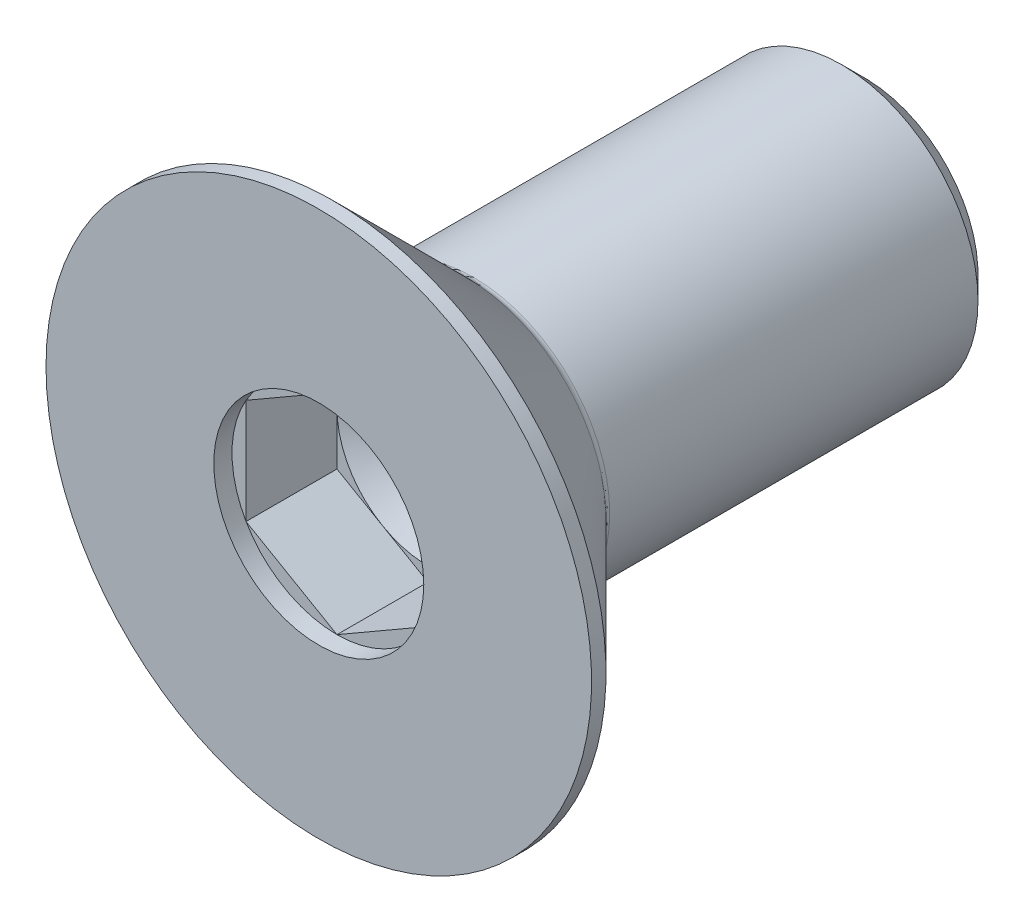
ISO-10303-21;
HEADER;
FILE_DESCRIPTION(('STEP AP214'),'2;1');
FILE_NAME('part.step','',(''),(''),'','','');
FILE_SCHEMA(('AUTOMOTIVE_DESIGN { 1 0 10303 214 1 1 1 1 }'));
ENDSEC;
DATA;
#1=APPLICATION_CONTEXT('core data for automotive mechanical design processes');
#2=APPLICATION_PROTOCOL_DEFINITION('international standard','automotive_design',2000,#1);
#3=PRODUCT_CONTEXT('',#1,'mechanical');
#4=PRODUCT('Part','Part','',(#3));
#5=PRODUCT_RELATED_PRODUCT_CATEGORY('part','',(#4));
#6=PRODUCT_DEFINITION_FORMATION('','',#4);
#7=PRODUCT_DEFINITION_CONTEXT('part definition',#1,'design');
#8=PRODUCT_DEFINITION('design','',#6,#7);
#9=PRODUCT_DEFINITION_SHAPE('','',#8);
#10=(LENGTH_UNIT() NAMED_UNIT(*) SI_UNIT(.MILLI.,.METRE.));
#11=(NAMED_UNIT(*) PLANE_ANGLE_UNIT() SI_UNIT($,.RADIAN.));
#12=(NAMED_UNIT(*) SI_UNIT($,.STERADIAN.) SOLID_ANGLE_UNIT());
#13=UNCERTAINTY_MEASURE_WITH_UNIT(LENGTH_MEASURE(1.E-05),#10,'distance_accuracy_value','');
#14=(GEOMETRIC_REPRESENTATION_CONTEXT(3) GLOBAL_UNCERTAINTY_ASSIGNED_CONTEXT((#13)) GLOBAL_UNIT_ASSIGNED_CONTEXT((#10,
#11,#12)) REPRESENTATION_CONTEXT('',''));
#15=CARTESIAN_POINT('',(0.,0.,0.));
#16=DIRECTION('',(0.,0.,1.));
#17=DIRECTION('',(1.,0.,0.));
#18=AXIS2_PLACEMENT_3D('',#15,#16,#17);
#19=CARTESIAN_POINT('',(0.,1.25,-6.00000000000001));
#20=DIRECTION('',(0.,0.,-1.));
#21=DIRECTION('',(-1.,0.,0.));
#22=AXIS2_PLACEMENT_3D('',#19,#20,#21);
#23=PLANE('',#22);
#24=CARTESIAN_POINT('',(0.,0.,-6.00000000000001));
#25=DIRECTION('',(0.,0.,-1.));
#26=DIRECTION('',(-1.,0.,0.));
#27=AXIS2_PLACEMENT_3D('',#24,#25,#26);
#28=CIRCLE('',#27,1.25);
#29=CARTESIAN_POINT('',(-1.25,0.,-6.00000000000001));
#30=VERTEX_POINT('',#29);
#31=EDGE_CURVE('E179',#30,#30,#28,.T.);
#32=ORIENTED_EDGE('',*,*,#31,.T.);
#33=EDGE_LOOP('',(#32));
#34=FACE_BOUND('',#33,.T.);
#35=ADVANCED_FACE('F35',(#34),#23,.T.);
#36=CARTESIAN_POINT('',(0.,0.,-6.00000000000001));
#37=DIRECTION('',(0.,0.,1.));
#38=DIRECTION('',(1.,0.,0.));
#39=AXIS2_PLACEMENT_3D('',#36,#37,#38);
#40=CONICAL_SURFACE('',#39,1.25,0.785398163397449);
#41=CARTESIAN_POINT('',(0.,0.,-5.75000000000001));
#42=DIRECTION('',(0.,0.,-1.));
#43=DIRECTION('',(-1.,0.,0.));
#44=AXIS2_PLACEMENT_3D('',#41,#42,#43);
#45=CIRCLE('',#44,1.5);
#46=CARTESIAN_POINT('',(-1.5,0.,-5.75000000000001));
#47=VERTEX_POINT('',#46);
#48=EDGE_CURVE('E177',#47,#47,#45,.T.);
#49=ORIENTED_EDGE('',*,*,#48,.T.);
#50=EDGE_LOOP('',(#49));
#51=FACE_BOUND('',#50,.T.);
#52=ORIENTED_EDGE('',*,*,#31,.F.);
#53=EDGE_LOOP('',(#52));
#54=FACE_BOUND('',#53,.T.);
#55=ADVANCED_FACE('F266',(#51,#54),#40,.T.);
#56=CARTESIAN_POINT('',(0.,0.,0.));
#57=DIRECTION('',(0.,0.,-1.));
#58=DIRECTION('',(-1.,0.,0.));
#59=AXIS2_PLACEMENT_3D('',#56,#57,#58);
#60=CYLINDRICAL_SURFACE('',#59,1.5);
#61=CARTESIAN_POINT('',(0.,0.,-1.7));
#62=DIRECTION('',(0.,0.,-1.));
#63=DIRECTION('',(-1.,0.,0.));
#64=AXIS2_PLACEMENT_3D('',#61,#62,#63);
#65=CIRCLE('',#64,1.5);
#66=CARTESIAN_POINT('',(-1.5,0.,-1.7));
#67=VERTEX_POINT('',#66);
#68=EDGE_CURVE('E174',#67,#67,#65,.T.);
#69=ORIENTED_EDGE('',*,*,#68,.T.);
#70=EDGE_LOOP('',(#69));
#71=FACE_BOUND('',#70,.T.);
#72=ORIENTED_EDGE('',*,*,#48,.F.);
#73=EDGE_LOOP('',(#72));
#74=FACE_BOUND('',#73,.T.);
#75=ADVANCED_FACE('F260',(#71,#74),#60,.T.);
#76=CARTESIAN_POINT('',(0.,0.,-1.7));
#77=DIRECTION('',(0.,0.,-1.));
#78=DIRECTION('',(-1.,0.,0.));
#79=AXIS2_PLACEMENT_3D('',#76,#77,#78);
#80=TOROIDAL_SURFACE('',#79,1.6,0.0999999999999993);
#81=CARTESIAN_POINT('',(0.,0.,-1.62928932188135));
#82=DIRECTION('',(0.,0.,-1.));
#83=DIRECTION('',(-1.,0.,0.));
#84=AXIS2_PLACEMENT_3D('',#81,#82,#83);
#85=CIRCLE('',#84,1.52928932188135);
#86=CARTESIAN_POINT('',(-1.52928932188135,0.,-1.62928932188135));
#87=VERTEX_POINT('',#86);
#88=EDGE_CURVE('E171',#87,#87,#85,.T.);
#89=ORIENTED_EDGE('',*,*,#88,.T.);
#90=EDGE_LOOP('',(#89));
#91=FACE_BOUND('',#90,.T.);
#92=ORIENTED_EDGE('',*,*,#68,.F.);
#93=EDGE_LOOP('',(#92));
#94=FACE_BOUND('',#93,.T.);
#95=ADVANCED_FACE('F254',(#91,#94),#80,.F.);
#96=CARTESIAN_POINT('',(0.,0.,-1.62928932188135));
#97=DIRECTION('',(0.,0.,1.));
#98=DIRECTION('',(1.,0.,0.));
#99=AXIS2_PLACEMENT_3D('',#96,#97,#98);
#100=CONICAL_SURFACE('',#99,1.52928932188135,0.785398163397442);
#101=CARTESIAN_POINT('',(0.,0.,-0.158578643762677));
#102=DIRECTION('',(0.,0.,-1.));
#103=DIRECTION('',(-1.,0.,0.));
#104=AXIS2_PLACEMENT_3D('',#101,#102,#103);
#105=CIRCLE('',#104,3.);
#106=CARTESIAN_POINT('',(-3.,0.,-0.158578643762677));
#107=VERTEX_POINT('',#106);
#108=EDGE_CURVE('E151',#107,#107,#105,.T.);
#109=ORIENTED_EDGE('',*,*,#108,.T.);
#110=EDGE_LOOP('',(#109));
#111=FACE_BOUND('',#110,.T.);
#112=ORIENTED_EDGE('',*,*,#88,.F.);
#113=EDGE_LOOP('',(#112));
#114=FACE_BOUND('',#113,.T.);
#115=ADVANCED_FACE('F248',(#111,#114),#100,.T.);
#116=CARTESIAN_POINT('',(0.,0.,0.));
#117=DIRECTION('',(0.,0.,-1.));
#118=DIRECTION('',(-1.,0.,0.));
#119=AXIS2_PLACEMENT_3D('',#116,#117,#118);
#120=CYLINDRICAL_SURFACE('',#119,3.);
#121=CARTESIAN_POINT('',(0.,0.,0.));
#122=DIRECTION('',(0.,0.,-1.));
#123=DIRECTION('',(-1.,0.,0.));
#124=AXIS2_PLACEMENT_3D('',#121,#122,#123);
#125=CIRCLE('',#124,3.);
#126=CARTESIAN_POINT('',(-3.,0.,0.));
#127=VERTEX_POINT('',#126);
#128=EDGE_CURVE('E148',#127,#127,#125,.T.);
#129=ORIENTED_EDGE('',*,*,#128,.T.);
#130=EDGE_LOOP('',(#129));
#131=FACE_BOUND('',#130,.T.);
#132=ORIENTED_EDGE('',*,*,#108,.F.);
#133=EDGE_LOOP('',(#132));
#134=FACE_BOUND('',#133,.T.);
#135=ADVANCED_FACE('F242',(#131,#134),#120,.T.);
#136=CARTESIAN_POINT('',(0.,0.,0.));
#137=DIRECTION('',(0.,0.,1.));
#138=DIRECTION('',(1.,0.,0.));
#139=AXIS2_PLACEMENT_3D('',#136,#137,#138);
#140=PLANE('',#139);
#141=CARTESIAN_POINT('',(0.,0.,0.));
#142=DIRECTION('',(0.,0.,1.));
#143=DIRECTION('',(1.,0.,0.));
#144=AXIS2_PLACEMENT_3D('',#141,#142,#143);
#145=CIRCLE('',#144,1.15470053837925);
#146=CARTESIAN_POINT('',(1.15470053837925,0.,0.));
#147=VERTEX_POINT('',#146);
#148=EDGE_CURVE('E128',#147,#147,#145,.T.);
#149=ORIENTED_EDGE('',*,*,#148,.F.);
#150=EDGE_LOOP('',(#149));
#151=FACE_BOUND('',#150,.T.);
#152=ORIENTED_EDGE('',*,*,#128,.F.);
#153=EDGE_LOOP('',(#152));
#154=FACE_BOUND('',#153,.T.);
#155=ADVANCED_FACE('F239',(#151,#154),#140,.T.);
#156=CARTESIAN_POINT('',(0.,0.,-0.2));
#157=DIRECTION('',(0.,0.,1.));
#158=DIRECTION('',(1.,0.,0.));
#159=AXIS2_PLACEMENT_3D('',#156,#157,#158);
#160=CYLINDRICAL_SURFACE('',#159,1.15470053837925);
#161=ORIENTED_EDGE('',*,*,#148,.T.);
#162=EDGE_LOOP('',(#161));
#163=FACE_BOUND('',#162,.T.);
#164=CARTESIAN_POINT('',(0.,0.,-0.2));
#165=DIRECTION('',(0.,0.,1.));
#166=DIRECTION('',(1.,0.,0.));
#167=AXIS2_PLACEMENT_3D('',#164,#165,#166);
#168=CIRCLE('',#167,1.15470053837925);
#169=CARTESIAN_POINT('',(0.999999999999996,-0.57735026918963,-0.2));
#170=VERTEX_POINT('',#169);
#171=CARTESIAN_POINT('',(0.999999999999998,0.577350269189626,-0.2));
#172=VERTEX_POINT('',#171);
#173=EDGE_CURVE('E121',#170,#172,#168,.T.);
#174=ORIENTED_EDGE('',*,*,#173,.F.);
#175=CARTESIAN_POINT('',(0.,-1.15470053837925,-0.2));
#176=VERTEX_POINT('',#175);
#177=EDGE_CURVE('E127',#176,#170,#168,.T.);
#178=ORIENTED_EDGE('',*,*,#177,.F.);
#179=CARTESIAN_POINT('',(-1.,-0.577350269189621,-0.2));
#180=VERTEX_POINT('',#179);
#181=EDGE_CURVE('E494',#180,#176,#168,.T.);
#182=ORIENTED_EDGE('',*,*,#181,.F.);
#183=CARTESIAN_POINT('',(-1.,0.577350269189625,-0.2));
#184=VERTEX_POINT('',#183);
#185=EDGE_CURVE('E496',#184,#180,#168,.T.);
#186=ORIENTED_EDGE('',*,*,#185,.F.);
#187=CARTESIAN_POINT('',(0.,1.15470053837925,-0.2));
#188=VERTEX_POINT('',#187);
#189=EDGE_CURVE('E47',#188,#184,#168,.T.);
#190=ORIENTED_EDGE('',*,*,#189,.F.);
#191=EDGE_CURVE('E111',#172,#188,#168,.T.);
#192=ORIENTED_EDGE('',*,*,#191,.F.);
#193=EDGE_LOOP('',(#174,#178,#182,#186,#190,#192));
#194=FACE_BOUND('',#193,.T.);
#195=ADVANCED_FACE('F130',(#163,#194),#160,.F.);
#196=CARTESIAN_POINT('',(0.,0.,-0.2));
#197=DIRECTION('',(0.,0.,1.));
#198=DIRECTION('',(1.,0.,0.));
#199=AXIS2_PLACEMENT_3D('',#196,#197,#198);
#200=PLANE('',#199);
#201=DIRECTION('',(0.866025403784439,-0.5,0.));
#202=VECTOR('',#201,1.);
#203=CARTESIAN_POINT('',(0.999999999999998,0.577350269189625,-0.2));
#204=LINE('',#203,#202);
#205=EDGE_CURVE('E107',#188,#172,#204,.T.);
#206=ORIENTED_EDGE('',*,*,#205,.T.);
#207=ORIENTED_EDGE('',*,*,#191,.T.);
#208=EDGE_LOOP('',(#206,#207));
#209=FACE_BOUND('',#208,.T.);
#210=ADVANCED_FACE('F109',(#209),#200,.T.);
#211=DIRECTION('',(0.,-1.,0.));
#212=VECTOR('',#211,1.);
#213=CARTESIAN_POINT('',(0.999999999999998,-0.577350269189628,-0.2));
#214=LINE('',#213,#212);
#215=EDGE_CURVE('E117',#172,#170,#214,.T.);
#216=ORIENTED_EDGE('',*,*,#215,.T.);
#217=ORIENTED_EDGE('',*,*,#173,.T.);
#218=EDGE_LOOP('',(#216,#217));
#219=FACE_BOUND('',#218,.T.);
#220=ADVANCED_FACE('F122',(#219),#200,.T.);
#221=DIRECTION('',(-0.866025403784439,-0.5,0.));
#222=VECTOR('',#221,1.);
#223=CARTESIAN_POINT('',(0.,-1.15470053837925,-0.2));
#224=LINE('',#223,#222);
#225=EDGE_CURVE('E142',#170,#176,#224,.T.);
#226=ORIENTED_EDGE('',*,*,#225,.T.);
#227=ORIENTED_EDGE('',*,*,#177,.T.);
#228=EDGE_LOOP('',(#226,#227));
#229=FACE_BOUND('',#228,.T.);
#230=ADVANCED_FACE('F305',(#229),#200,.T.);
#231=DIRECTION('',(-0.866025403784439,0.5,0.));
#232=VECTOR('',#231,1.);
#233=CARTESIAN_POINT('',(-1.,-0.577350269189627,-0.2));
#234=LINE('',#233,#232);
#235=EDGE_CURVE('E229',#176,#180,#234,.T.);
#236=ORIENTED_EDGE('',*,*,#235,.T.);
#237=ORIENTED_EDGE('',*,*,#181,.T.);
#238=EDGE_LOOP('',(#236,#237));
#239=FACE_BOUND('',#238,.T.);
#240=ADVANCED_FACE('F311',(#239),#200,.T.);
#241=DIRECTION('',(0.,1.,0.));
#242=VECTOR('',#241,1.);
#243=CARTESIAN_POINT('',(-1.,0.577350269189625,-0.2));
#244=LINE('',#243,#242);
#245=EDGE_CURVE('E131',#180,#184,#244,.T.);
#246=ORIENTED_EDGE('',*,*,#245,.T.);
#247=ORIENTED_EDGE('',*,*,#185,.T.);
#248=EDGE_LOOP('',(#246,#247));
#249=FACE_BOUND('',#248,.T.);
#250=ADVANCED_FACE('F307',(#249),#200,.T.);
#251=DIRECTION('',(0.866025403784439,0.5,0.));
#252=VECTOR('',#251,1.);
#253=CARTESIAN_POINT('',(0.,1.15470053837925,-0.2));
#254=LINE('',#253,#252);
#255=EDGE_CURVE('E11',#184,#188,#254,.T.);
#256=ORIENTED_EDGE('',*,*,#255,.T.);
#257=ORIENTED_EDGE('',*,*,#189,.T.);
#258=EDGE_LOOP('',(#256,#257));
#259=FACE_BOUND('',#258,.T.);
#260=ADVANCED_FACE('F298',(#259),#200,.T.);
#261=CARTESIAN_POINT('',(0.,0.,-1.77735026918962));
#262=DIRECTION('',(0.,0.,1.));
#263=DIRECTION('',(1.,0.,0.));
#264=AXIS2_PLACEMENT_3D('',#261,#262,#263);
#265=CONICAL_SURFACE('',#264,0.,1.0471975511966);
#266=CARTESIAN_POINT('',(0.,0.,-1.2));
#267=DIRECTION('',(0.,0.,1.));
#268=DIRECTION('',(1.,0.,0.));
#269=AXIS2_PLACEMENT_3D('',#266,#267,#268);
#270=CIRCLE('',#269,1.);
#271=CARTESIAN_POINT('',(1.,0.,-1.2));
#272=VERTEX_POINT('',#271);
#273=CARTESIAN_POINT('',(0.5,0.866025403784439,-1.2));
#274=VERTEX_POINT('',#273);
#275=EDGE_CURVE('E116',#272,#274,#270,.T.);
#276=ORIENTED_EDGE('',*,*,#275,.T.);
#277=CARTESIAN_POINT('',(-0.5,0.866025403784439,-1.2));
#278=VERTEX_POINT('',#277);
#279=EDGE_CURVE('E42',#274,#278,#270,.T.);
#280=ORIENTED_EDGE('',*,*,#279,.T.);
#281=CARTESIAN_POINT('',(-1.,0.,-1.2));
#282=VERTEX_POINT('',#281);
#283=EDGE_CURVE('E190',#278,#282,#270,.T.);
#284=ORIENTED_EDGE('',*,*,#283,.T.);
#285=CARTESIAN_POINT('',(-0.5,-0.866025403784439,-1.2));
#286=VERTEX_POINT('',#285);
#287=EDGE_CURVE('E186',#282,#286,#270,.T.);
#288=ORIENTED_EDGE('',*,*,#287,.T.);
#289=CARTESIAN_POINT('',(0.5,-0.86602540378444,-1.2));
#290=VERTEX_POINT('',#289);
#291=EDGE_CURVE('E55',#286,#290,#270,.T.);
#292=ORIENTED_EDGE('',*,*,#291,.T.);
#293=EDGE_CURVE('E181',#290,#272,#270,.T.);
#294=ORIENTED_EDGE('',*,*,#293,.T.);
#295=EDGE_LOOP('',(#276,#280,#284,#288,#292,#294));
#296=FACE_BOUND('',#295,.T.);
#297=CARTESIAN_POINT('',(0.,0.,-1.77735026918962));
#298=VERTEX_POINT('',#297);
#299=VERTEX_LOOP('',#298);
#300=FACE_BOUND('',#299,.T.);
#301=ADVANCED_FACE('F193',(#296,#300),#265,.F.);
#302=CARTESIAN_POINT('',(0.,0.,-1.2));
#303=DIRECTION('',(0.,0.,1.));
#304=DIRECTION('',(1.,0.,0.));
#305=AXIS2_PLACEMENT_3D('',#302,#303,#304);
#306=PLANE('',#305);
#307=ORIENTED_EDGE('',*,*,#275,.F.);
#308=DIRECTION('',(0.,1.,0.));
#309=VECTOR('',#308,1.);
#310=CARTESIAN_POINT('',(0.999999999999998,-0.577350269189628,-1.2));
#311=LINE('',#310,#309);
#312=CARTESIAN_POINT('',(0.999999999999998,0.577350269189625,-1.2));
#313=VERTEX_POINT('',#312);
#314=EDGE_CURVE('E219',#272,#313,#311,.T.);
#315=ORIENTED_EDGE('',*,*,#314,.T.);
#316=DIRECTION('',(-0.866025403784439,0.5,0.));
#317=VECTOR('',#316,1.);
#318=CARTESIAN_POINT('',(0.999999999999998,0.577350269189625,-1.2));
#319=LINE('',#318,#317);
#320=EDGE_CURVE('E147',#313,#274,#319,.T.);
#321=ORIENTED_EDGE('',*,*,#320,.T.);
#322=EDGE_LOOP('',(#307,#315,#321));
#323=FACE_BOUND('',#322,.T.);
#324=ADVANCED_FACE('F295',(#323),#306,.T.);
#325=ORIENTED_EDGE('',*,*,#293,.F.);
#326=DIRECTION('',(0.866025403784439,0.5,0.));
#327=VECTOR('',#326,1.);
#328=CARTESIAN_POINT('',(0.,-1.15470053837925,-1.2));
#329=LINE('',#328,#327);
#330=CARTESIAN_POINT('',(0.999999999999998,-0.577350269189628,-1.2));
#331=VERTEX_POINT('',#330);
#332=EDGE_CURVE('E216',#290,#331,#329,.T.);
#333=ORIENTED_EDGE('',*,*,#332,.T.);
#334=EDGE_CURVE('E156',#331,#272,#311,.T.);
#335=ORIENTED_EDGE('',*,*,#334,.T.);
#336=EDGE_LOOP('',(#325,#333,#335));
#337=FACE_BOUND('',#336,.T.);
#338=ADVANCED_FACE('F223',(#337),#306,.T.);
#339=ORIENTED_EDGE('',*,*,#291,.F.);
#340=DIRECTION('',(0.866025403784439,-0.5,0.));
#341=VECTOR('',#340,1.);
#342=CARTESIAN_POINT('',(-1.,-0.577350269189627,-1.2));
#343=LINE('',#342,#341);
#344=CARTESIAN_POINT('',(0.,-1.15470053837925,-1.2));
#345=VERTEX_POINT('',#344);
#346=EDGE_CURVE('E202',#286,#345,#343,.T.);
#347=ORIENTED_EDGE('',*,*,#346,.T.);
#348=EDGE_CURVE('E205',#345,#290,#329,.T.);
#349=ORIENTED_EDGE('',*,*,#348,.T.);
#350=EDGE_LOOP('',(#339,#347,#349));
#351=FACE_BOUND('',#350,.T.);
#352=ADVANCED_FACE('F201',(#351),#306,.T.);
#353=ORIENTED_EDGE('',*,*,#287,.F.);
#354=DIRECTION('',(0.,-1.,0.));
#355=VECTOR('',#354,1.);
#356=CARTESIAN_POINT('',(-1.,0.577350269189625,-1.2));
#357=LINE('',#356,#355);
#358=CARTESIAN_POINT('',(-1.,-0.577350269189627,-1.2));
#359=VERTEX_POINT('',#358);
#360=EDGE_CURVE('E214',#282,#359,#357,.T.);
#361=ORIENTED_EDGE('',*,*,#360,.T.);
#362=EDGE_CURVE('E210',#359,#286,#343,.T.);
#363=ORIENTED_EDGE('',*,*,#362,.T.);
#364=EDGE_LOOP('',(#353,#361,#363));
#365=FACE_BOUND('',#364,.T.);
#366=ADVANCED_FACE('F213',(#365),#306,.T.);
#367=ORIENTED_EDGE('',*,*,#279,.F.);
#368=CARTESIAN_POINT('',(0.,1.15470053837925,-1.2));
#369=VERTEX_POINT('',#368);
#370=EDGE_CURVE('E188',#274,#369,#319,.T.);
#371=ORIENTED_EDGE('',*,*,#370,.T.);
#372=DIRECTION('',(-0.866025403784439,-0.5,0.));
#373=VECTOR('',#372,1.);
#374=CARTESIAN_POINT('',(0.,1.15470053837925,-1.2));
#375=LINE('',#374,#373);
#376=EDGE_CURVE('E321',#369,#278,#375,.T.);
#377=ORIENTED_EDGE('',*,*,#376,.T.);
#378=EDGE_LOOP('',(#367,#371,#377));
#379=FACE_BOUND('',#378,.T.);
#380=ADVANCED_FACE('F326',(#379),#306,.T.);
#381=ORIENTED_EDGE('',*,*,#283,.F.);
#382=CARTESIAN_POINT('',(-1.,0.577350269189625,-1.2));
#383=VERTEX_POINT('',#382);
#384=EDGE_CURVE('E323',#278,#383,#375,.T.);
#385=ORIENTED_EDGE('',*,*,#384,.T.);
#386=EDGE_CURVE('E211',#383,#282,#357,.T.);
#387=ORIENTED_EDGE('',*,*,#386,.T.);
#388=EDGE_LOOP('',(#381,#385,#387));
#389=FACE_BOUND('',#388,.T.);
#390=ADVANCED_FACE('F282',(#389),#306,.T.);
#391=CARTESIAN_POINT('',(0.,1.15470053837925,-1.2));
#392=DIRECTION('',(-0.5,0.866025403784439,0.));
#393=DIRECTION('',(-0.866025403784439,-0.5,0.));
#394=AXIS2_PLACEMENT_3D('',#391,#392,#393);
#395=PLANE('',#394);
#396=ORIENTED_EDGE('',*,*,#255,.F.);
#397=DIRECTION('',(0.,0.,1.));
#398=VECTOR('',#397,1.);
#399=CARTESIAN_POINT('',(-1.,0.577350269189625,-1.2));
#400=LINE('',#399,#398);
#401=EDGE_CURVE('E164',#383,#184,#400,.T.);
#402=ORIENTED_EDGE('',*,*,#401,.F.);
#403=ORIENTED_EDGE('',*,*,#384,.F.);
#404=ORIENTED_EDGE('',*,*,#376,.F.);
#405=DIRECTION('',(0.,0.,1.));
#406=VECTOR('',#405,1.);
#407=CARTESIAN_POINT('',(0.,1.15470053837925,-1.2));
#408=LINE('',#407,#406);
#409=EDGE_CURVE('E167',#369,#188,#408,.T.);
#410=ORIENTED_EDGE('',*,*,#409,.T.);
#411=EDGE_LOOP('',(#396,#402,#403,#404,#410));
#412=FACE_BOUND('',#411,.T.);
#413=ADVANCED_FACE('F278',(#412),#395,.F.);
#414=CARTESIAN_POINT('',(-1.,0.577350269189625,-1.2));
#415=DIRECTION('',(-1.,0.,0.));
#416=DIRECTION('',(0.,-1.,0.));
#417=AXIS2_PLACEMENT_3D('',#414,#415,#416);
#418=PLANE('',#417);
#419=ORIENTED_EDGE('',*,*,#245,.F.);
#420=DIRECTION('',(0.,0.,1.));
#421=VECTOR('',#420,1.);
#422=CARTESIAN_POINT('',(-1.,-0.577350269189627,-1.2));
#423=LINE('',#422,#421);
#424=EDGE_CURVE('E161',#359,#180,#423,.T.);
#425=ORIENTED_EDGE('',*,*,#424,.F.);
#426=ORIENTED_EDGE('',*,*,#360,.F.);
#427=ORIENTED_EDGE('',*,*,#386,.F.);
#428=ORIENTED_EDGE('',*,*,#401,.T.);
#429=EDGE_LOOP('',(#419,#425,#426,#427,#428));
#430=FACE_BOUND('',#429,.T.);
#431=ADVANCED_FACE('F281',(#430),#418,.F.);
#432=CARTESIAN_POINT('',(-1.,-0.577350269189627,-1.2));
#433=DIRECTION('',(-0.5,-0.866025403784439,0.));
#434=DIRECTION('',(0.866025403784439,-0.5,0.));
#435=AXIS2_PLACEMENT_3D('',#432,#433,#434);
#436=PLANE('',#435);
#437=ORIENTED_EDGE('',*,*,#235,.F.);
#438=DIRECTION('',(0.,0.,1.));
#439=VECTOR('',#438,1.);
#440=CARTESIAN_POINT('',(0.,-1.15470053837925,-1.2));
#441=LINE('',#440,#439);
#442=EDGE_CURVE('E153',#345,#176,#441,.T.);
#443=ORIENTED_EDGE('',*,*,#442,.F.);
#444=ORIENTED_EDGE('',*,*,#346,.F.);
#445=ORIENTED_EDGE('',*,*,#362,.F.);
#446=ORIENTED_EDGE('',*,*,#424,.T.);
#447=EDGE_LOOP('',(#437,#443,#444,#445,#446));
#448=FACE_BOUND('',#447,.T.);
#449=ADVANCED_FACE('F209',(#448),#436,.F.);
#450=CARTESIAN_POINT('',(0.,-1.15470053837925,-1.2));
#451=DIRECTION('',(0.5,-0.866025403784439,0.));
#452=DIRECTION('',(0.866025403784439,0.5,0.));
#453=AXIS2_PLACEMENT_3D('',#450,#451,#452);
#454=PLANE('',#453);
#455=ORIENTED_EDGE('',*,*,#225,.F.);
#456=DIRECTION('',(0.,0.,1.));
#457=VECTOR('',#456,1.);
#458=CARTESIAN_POINT('',(0.999999999999998,-0.577350269189628,-1.2));
#459=LINE('',#458,#457);
#460=EDGE_CURVE('E141',#331,#170,#459,.T.);
#461=ORIENTED_EDGE('',*,*,#460,.F.);
#462=ORIENTED_EDGE('',*,*,#332,.F.);
#463=ORIENTED_EDGE('',*,*,#348,.F.);
#464=ORIENTED_EDGE('',*,*,#442,.T.);
#465=EDGE_LOOP('',(#455,#461,#462,#463,#464));
#466=FACE_BOUND('',#465,.T.);
#467=ADVANCED_FACE('F227',(#466),#454,.F.);
#468=CARTESIAN_POINT('',(0.999999999999998,-0.577350269189628,-1.2));
#469=DIRECTION('',(1.,0.,0.));
#470=DIRECTION('',(0.,0.,-1.));
#471=AXIS2_PLACEMENT_3D('',#468,#469,#470);
#472=PLANE('',#471);
#473=ORIENTED_EDGE('',*,*,#215,.F.);
#474=DIRECTION('',(0.,0.,1.));
#475=VECTOR('',#474,1.);
#476=CARTESIAN_POINT('',(0.999999999999998,0.577350269189625,-1.2));
#477=LINE('',#476,#475);
#478=EDGE_CURVE('E137',#313,#172,#477,.T.);
#479=ORIENTED_EDGE('',*,*,#478,.F.);
#480=ORIENTED_EDGE('',*,*,#314,.F.);
#481=ORIENTED_EDGE('',*,*,#334,.F.);
#482=ORIENTED_EDGE('',*,*,#460,.T.);
#483=EDGE_LOOP('',(#473,#479,#480,#481,#482));
#484=FACE_BOUND('',#483,.T.);
#485=ADVANCED_FACE('F135',(#484),#472,.F.);
#486=CARTESIAN_POINT('',(0.999999999999998,0.577350269189625,-1.2));
#487=DIRECTION('',(0.5,0.866025403784439,0.));
#488=DIRECTION('',(-0.866025403784439,0.5,0.));
#489=AXIS2_PLACEMENT_3D('',#486,#487,#488);
#490=PLANE('',#489);
#491=ORIENTED_EDGE('',*,*,#205,.F.);
#492=ORIENTED_EDGE('',*,*,#409,.F.);
#493=ORIENTED_EDGE('',*,*,#370,.F.);
#494=ORIENTED_EDGE('',*,*,#320,.F.);
#495=ORIENTED_EDGE('',*,*,#478,.T.);
#496=EDGE_LOOP('',(#491,#492,#493,#494,#495));
#497=FACE_BOUND('',#496,.T.);
#498=ADVANCED_FACE('F144',(#497),#490,.F.);
#499=CLOSED_SHELL('',(#35,#55,#75,#95,#115,#135,#155,#195,#210,#220,#230,#240,#250,#260,#301,
#324,#338,#352,#366,#380,#390,#413,#431,#449,#467,#485,#498));
#500=MANIFOLD_SOLID_BREP('B2',#499);
#501=ADVANCED_BREP_SHAPE_REPRESENTATION('',(#18,#500),#14);
#502=SHAPE_DEFINITION_REPRESENTATION(#9,#501);
ENDSEC;
END-ISO-10303-21;
